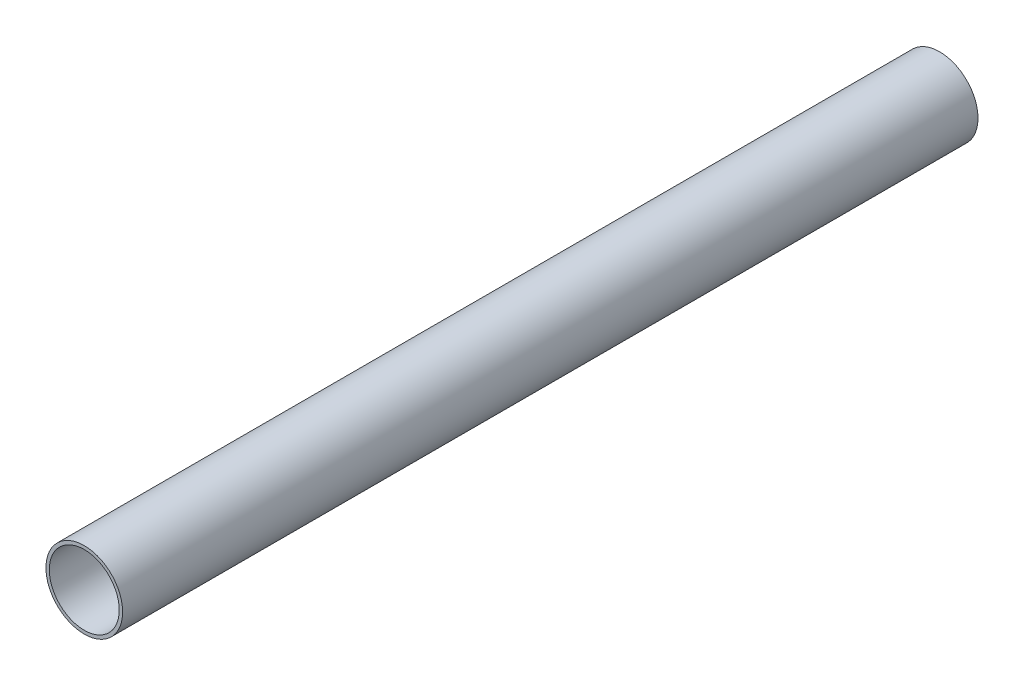
ISO-10303-21;
HEADER;
FILE_DESCRIPTION(('STEP AP214'),'2;1');
FILE_NAME('part.step','',(''),(''),'','','');
FILE_SCHEMA(('AUTOMOTIVE_DESIGN { 1 0 10303 214 1 1 1 1 }'));
ENDSEC;
DATA;
#1=APPLICATION_CONTEXT('core data for automotive mechanical design processes');
#2=APPLICATION_PROTOCOL_DEFINITION('international standard','automotive_design',2000,#1);
#3=PRODUCT_CONTEXT('',#1,'mechanical');
#4=PRODUCT('Part','Part','',(#3));
#5=PRODUCT_RELATED_PRODUCT_CATEGORY('part','',(#4));
#6=PRODUCT_DEFINITION_FORMATION('','',#4);
#7=PRODUCT_DEFINITION_CONTEXT('part definition',#1,'design');
#8=PRODUCT_DEFINITION('design','',#6,#7);
#9=PRODUCT_DEFINITION_SHAPE('','',#8);
#10=(LENGTH_UNIT() NAMED_UNIT(*) SI_UNIT(.MILLI.,.METRE.));
#11=(NAMED_UNIT(*) PLANE_ANGLE_UNIT() SI_UNIT($,.RADIAN.));
#12=(NAMED_UNIT(*) SI_UNIT($,.STERADIAN.) SOLID_ANGLE_UNIT());
#13=UNCERTAINTY_MEASURE_WITH_UNIT(LENGTH_MEASURE(1.E-05),#10,'distance_accuracy_value','');
#14=(GEOMETRIC_REPRESENTATION_CONTEXT(3) GLOBAL_UNCERTAINTY_ASSIGNED_CONTEXT((#13)) GLOBAL_UNIT_ASSIGNED_CONTEXT((#10,
#11,#12)) REPRESENTATION_CONTEXT('',''));
#15=CARTESIAN_POINT('',(0.,0.,0.));
#16=DIRECTION('',(0.,0.,1.));
#17=DIRECTION('',(1.,0.,0.));
#18=AXIS2_PLACEMENT_3D('',#15,#16,#17);
#19=CARTESIAN_POINT('',(0.,0.,355.6));
#20=DIRECTION('',(0.,0.,1.));
#21=DIRECTION('',(1.,0.,0.));
#22=AXIS2_PLACEMENT_3D('',#19,#20,#21);
#23=PLANE('',#22);
#24=CARTESIAN_POINT('',(0.,0.,355.6));
#25=DIRECTION('',(0.,0.,1.));
#26=DIRECTION('',(1.,0.,0.));
#27=AXIS2_PLACEMENT_3D('',#24,#25,#26);
#28=CIRCLE('',#27,15.9385);
#29=CARTESIAN_POINT('',(15.9385,0.,355.6));
#30=VERTEX_POINT('',#29);
#31=EDGE_CURVE('E10',#30,#30,#28,.T.);
#32=ORIENTED_EDGE('',*,*,#31,.T.);
#33=EDGE_LOOP('',(#32));
#34=FACE_BOUND('',#33,.T.);
#35=CARTESIAN_POINT('',(0.,0.,355.6));
#36=DIRECTION('',(0.,0.,1.));
#37=DIRECTION('',(1.,0.,0.));
#38=AXIS2_PLACEMENT_3D('',#35,#36,#37);
#39=CIRCLE('',#38,14.5415);
#40=CARTESIAN_POINT('',(14.5415,0.,355.6));
#41=VERTEX_POINT('',#40);
#42=EDGE_CURVE('E42',#41,#41,#39,.T.);
#43=ORIENTED_EDGE('',*,*,#42,.F.);
#44=EDGE_LOOP('',(#43));
#45=FACE_BOUND('',#44,.T.);
#46=ADVANCED_FACE('F31',(#34,#45),#23,.T.);
#47=CARTESIAN_POINT('',(0.,0.,0.));
#48=DIRECTION('',(0.,0.,1.));
#49=DIRECTION('',(1.,0.,0.));
#50=AXIS2_PLACEMENT_3D('',#47,#48,#49);
#51=PLANE('',#50);
#52=CARTESIAN_POINT('',(0.,0.,0.));
#53=DIRECTION('',(0.,0.,1.));
#54=DIRECTION('',(1.,0.,0.));
#55=AXIS2_PLACEMENT_3D('',#52,#53,#54);
#56=CIRCLE('',#55,15.9385);
#57=CARTESIAN_POINT('',(15.9385,0.,0.));
#58=VERTEX_POINT('',#57);
#59=EDGE_CURVE('E35',#58,#58,#56,.T.);
#60=ORIENTED_EDGE('',*,*,#59,.F.);
#61=EDGE_LOOP('',(#60));
#62=FACE_BOUND('',#61,.T.);
#63=CARTESIAN_POINT('',(0.,0.,0.));
#64=DIRECTION('',(0.,0.,1.));
#65=DIRECTION('',(1.,0.,0.));
#66=AXIS2_PLACEMENT_3D('',#63,#64,#65);
#67=CIRCLE('',#66,14.5415);
#68=CARTESIAN_POINT('',(14.5415,0.,0.));
#69=VERTEX_POINT('',#68);
#70=EDGE_CURVE('E44',#69,#69,#67,.T.);
#71=ORIENTED_EDGE('',*,*,#70,.T.);
#72=EDGE_LOOP('',(#71));
#73=FACE_BOUND('',#72,.T.);
#74=ADVANCED_FACE('F54',(#62,#73),#51,.F.);
#75=CARTESIAN_POINT('',(0.,0.,355.6));
#76=DIRECTION('',(0.,0.,-1.));
#77=DIRECTION('',(-1.,0.,0.));
#78=AXIS2_PLACEMENT_3D('',#75,#76,#77);
#79=CYLINDRICAL_SURFACE('',#78,15.9385);
#80=ORIENTED_EDGE('',*,*,#31,.F.);
#81=EDGE_LOOP('',(#80));
#82=FACE_BOUND('',#81,.T.);
#83=ORIENTED_EDGE('',*,*,#59,.T.);
#84=EDGE_LOOP('',(#83));
#85=FACE_BOUND('',#84,.T.);
#86=ADVANCED_FACE('F33',(#82,#85),#79,.T.);
#87=CARTESIAN_POINT('',(0.,0.,355.6));
#88=DIRECTION('',(0.,0.,-1.));
#89=DIRECTION('',(-1.,0.,0.));
#90=AXIS2_PLACEMENT_3D('',#87,#88,#89);
#91=CYLINDRICAL_SURFACE('',#90,14.5415);
#92=ORIENTED_EDGE('',*,*,#42,.T.);
#93=EDGE_LOOP('',(#92));
#94=FACE_BOUND('',#93,.T.);
#95=ORIENTED_EDGE('',*,*,#70,.F.);
#96=EDGE_LOOP('',(#95));
#97=FACE_BOUND('',#96,.T.);
#98=ADVANCED_FACE('F50',(#94,#97),#91,.F.);
#99=CLOSED_SHELL('',(#46,#74,#86,#98));
#100=MANIFOLD_SOLID_BREP('B2',#99);
#101=ADVANCED_BREP_SHAPE_REPRESENTATION('',(#18,#100),#14);
#102=SHAPE_DEFINITION_REPRESENTATION(#9,#101);
ENDSEC;
END-ISO-10303-21;
